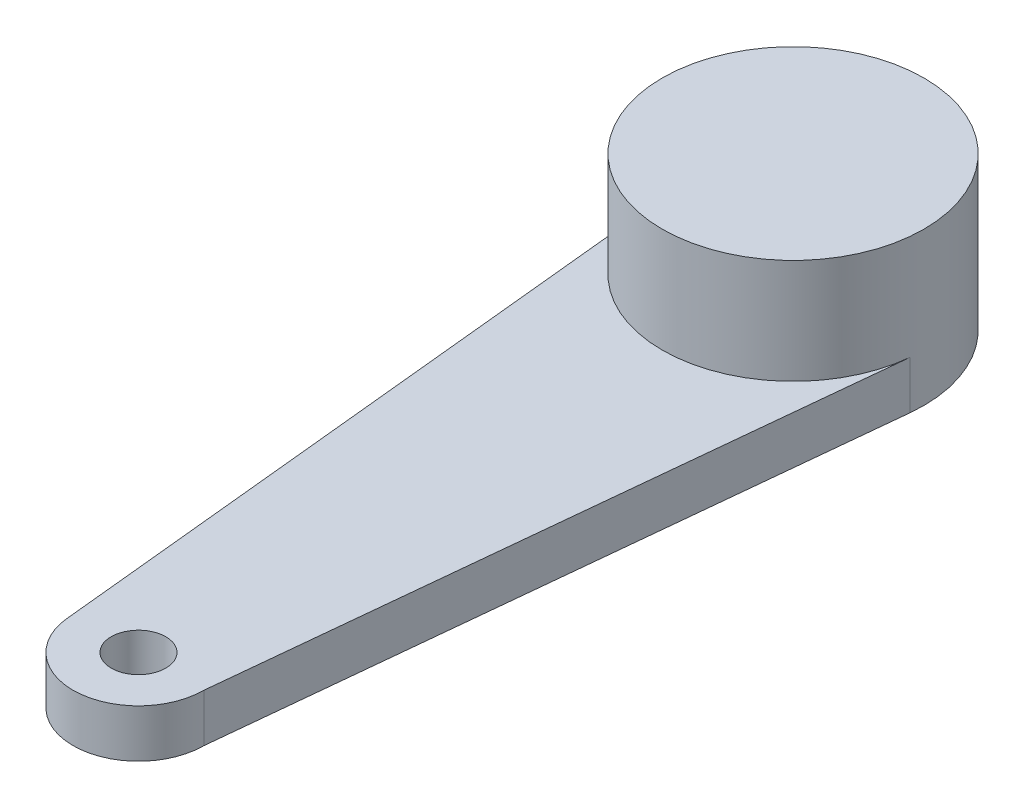
ISO-10303-21;
HEADER;
FILE_DESCRIPTION(('STEP AP214'),'2;1');
FILE_NAME('part.step','',(''),(''),'','','');
FILE_SCHEMA(('AUTOMOTIVE_DESIGN { 1 0 10303 214 1 1 1 1 }'));
ENDSEC;
DATA;
#1=APPLICATION_CONTEXT('core data for automotive mechanical design processes');
#2=APPLICATION_PROTOCOL_DEFINITION('international standard','automotive_design',2000,#1);
#3=PRODUCT_CONTEXT('',#1,'mechanical');
#4=PRODUCT('Part','Part','',(#3));
#5=PRODUCT_RELATED_PRODUCT_CATEGORY('part','',(#4));
#6=PRODUCT_DEFINITION_FORMATION('','',#4);
#7=PRODUCT_DEFINITION_CONTEXT('part definition',#1,'design');
#8=PRODUCT_DEFINITION('design','',#6,#7);
#9=PRODUCT_DEFINITION_SHAPE('','',#8);
#10=(LENGTH_UNIT() NAMED_UNIT(*) SI_UNIT(.MILLI.,.METRE.));
#11=(NAMED_UNIT(*) PLANE_ANGLE_UNIT() SI_UNIT($,.RADIAN.));
#12=(NAMED_UNIT(*) SI_UNIT($,.STERADIAN.) SOLID_ANGLE_UNIT());
#13=UNCERTAINTY_MEASURE_WITH_UNIT(LENGTH_MEASURE(1.E-05),#10,'distance_accuracy_value','');
#14=(GEOMETRIC_REPRESENTATION_CONTEXT(3) GLOBAL_UNCERTAINTY_ASSIGNED_CONTEXT((#13)) GLOBAL_UNIT_ASSIGNED_CONTEXT((#10,
#11,#12)) REPRESENTATION_CONTEXT('',''));
#15=CARTESIAN_POINT('',(0.,0.,0.));
#16=DIRECTION('',(0.,0.,1.));
#17=DIRECTION('',(1.,0.,0.));
#18=AXIS2_PLACEMENT_3D('',#15,#16,#17);
#19=CARTESIAN_POINT('',(0.,3.5,0.));
#20=DIRECTION('',(0.,-1.,0.));
#21=DIRECTION('',(0.,0.,-1.));
#22=AXIS2_PLACEMENT_3D('',#19,#20,#21);
#23=CYLINDRICAL_SURFACE('',#22,3.);
#24=CARTESIAN_POINT('',(0.,1.1,0.));
#25=DIRECTION('',(0.,1.,0.));
#26=DIRECTION('',(0.,0.,1.));
#27=AXIS2_PLACEMENT_3D('',#24,#25,#26);
#28=CIRCLE('',#27,3.);
#29=CARTESIAN_POINT('',(-2.98496231131986,1.1,0.3));
#30=VERTEX_POINT('',#29);
#31=CARTESIAN_POINT('',(2.98480924805825,1.1,0.301519075194175));
#32=VERTEX_POINT('',#31);
#33=EDGE_CURVE('E53',#30,#32,#28,.T.);
#34=ORIENTED_EDGE('',*,*,#33,.T.);
#35=DIRECTION('',(0.,-1.,0.));
#36=VECTOR('',#35,1.);
#37=CARTESIAN_POINT('',(2.98480924805825,1.1,0.301519075194175));
#38=LINE('',#37,#36);
#39=CARTESIAN_POINT('',(2.98480924805825,0.,0.301519075194175));
#40=VERTEX_POINT('',#39);
#41=EDGE_CURVE('E98',#32,#40,#38,.T.);
#42=ORIENTED_EDGE('',*,*,#41,.T.);
#43=CARTESIAN_POINT('',(0.,0.,0.));
#44=DIRECTION('',(0.,1.,0.));
#45=DIRECTION('',(0.,0.,1.));
#46=AXIS2_PLACEMENT_3D('',#43,#44,#45);
#47=CIRCLE('',#46,3.);
#48=CARTESIAN_POINT('',(-2.98496231131986,0.,0.3));
#49=VERTEX_POINT('',#48);
#50=EDGE_CURVE('E42',#40,#49,#47,.T.);
#51=ORIENTED_EDGE('',*,*,#50,.T.);
#52=DIRECTION('',(0.,-1.,0.));
#53=VECTOR('',#52,1.);
#54=CARTESIAN_POINT('',(-2.98496231131986,1.1,0.3));
#55=LINE('',#54,#53);
#56=EDGE_CURVE('E58',#30,#49,#55,.T.);
#57=ORIENTED_EDGE('',*,*,#56,.F.);
#58=EDGE_LOOP('',(#34,#42,#51,#57));
#59=FACE_BOUND('',#58,.T.);
#60=CARTESIAN_POINT('',(0.,3.5,0.));
#61=DIRECTION('',(0.,1.,0.));
#62=DIRECTION('',(0.,0.,1.));
#63=AXIS2_PLACEMENT_3D('',#60,#61,#62);
#64=CIRCLE('',#63,3.);
#65=CARTESIAN_POINT('',(0.,3.5,3.));
#66=VERTEX_POINT('',#65);
#67=EDGE_CURVE('E11',#66,#66,#64,.T.);
#68=ORIENTED_EDGE('',*,*,#67,.F.);
#69=EDGE_LOOP('',(#68));
#70=FACE_BOUND('',#69,.T.);
#71=ADVANCED_FACE('F39',(#59,#70),#23,.T.);
#72=CARTESIAN_POINT('',(0.,3.5,0.));
#73=DIRECTION('',(0.,1.,0.));
#74=DIRECTION('',(0.,0.,1.));
#75=AXIS2_PLACEMENT_3D('',#72,#73,#74);
#76=PLANE('',#75);
#77=ORIENTED_EDGE('',*,*,#67,.T.);
#78=EDGE_LOOP('',(#77));
#79=FACE_BOUND('',#78,.T.);
#80=ADVANCED_FACE('F137',(#79),#76,.T.);
#81=CARTESIAN_POINT('',(0.,0.,0.));
#82=DIRECTION('',(0.,1.,0.));
#83=DIRECTION('',(0.,0.,1.));
#84=AXIS2_PLACEMENT_3D('',#81,#82,#83);
#85=PLANE('',#84);
#86=ORIENTED_EDGE('',*,*,#50,.F.);
#87=DIRECTION('',(-0.100506358398058,0.,0.994936416019416));
#88=VECTOR('',#87,1.);
#89=CARTESIAN_POINT('',(2.98480924805825,0.,0.301519075194175));
#90=LINE('',#89,#88);
#91=CARTESIAN_POINT('',(1.5,0.,15.));
#92=VERTEX_POINT('',#91);
#93=EDGE_CURVE('E111',#40,#92,#90,.T.);
#94=ORIENTED_EDGE('',*,*,#93,.T.);
#95=CARTESIAN_POINT('',(0.,0.,15.));
#96=DIRECTION('',(0.,1.,0.));
#97=DIRECTION('',(0.,0.,1.));
#98=AXIS2_PLACEMENT_3D('',#95,#96,#97);
#99=CIRCLE('',#98,1.5);
#100=CARTESIAN_POINT('',(-1.49248115565993,0.,15.15));
#101=VERTEX_POINT('',#100);
#102=EDGE_CURVE('E94',#101,#92,#99,.T.);
#103=ORIENTED_EDGE('',*,*,#102,.F.);
#104=DIRECTION('',(0.1,0.,0.99498743710662));
#105=VECTOR('',#104,1.);
#106=CARTESIAN_POINT('',(-2.98496231131986,0.,0.3));
#107=LINE('',#106,#105);
#108=EDGE_CURVE('E113',#49,#101,#107,.T.);
#109=ORIENTED_EDGE('',*,*,#108,.F.);
#110=EDGE_LOOP('',(#86,#94,#103,#109));
#111=FACE_BOUND('',#110,.T.);
#112=CARTESIAN_POINT('',(0.,0.,15.));
#113=DIRECTION('',(0.,1.,0.));
#114=DIRECTION('',(0.,0.,1.));
#115=AXIS2_PLACEMENT_3D('',#112,#113,#114);
#116=CIRCLE('',#115,0.625);
#117=CARTESIAN_POINT('',(0.,0.,15.625));
#118=VERTEX_POINT('',#117);
#119=EDGE_CURVE('E107',#118,#118,#116,.T.);
#120=ORIENTED_EDGE('',*,*,#119,.T.);
#121=EDGE_LOOP('',(#120));
#122=FACE_BOUND('',#121,.T.);
#123=ADVANCED_FACE('F119',(#111,#122),#85,.F.);
#124=CARTESIAN_POINT('',(0.,1.1,15.));
#125=DIRECTION('',(0.,-1.,0.));
#126=DIRECTION('',(0.,0.,-1.));
#127=AXIS2_PLACEMENT_3D('',#124,#125,#126);
#128=CYLINDRICAL_SURFACE('',#127,1.5);
#129=ORIENTED_EDGE('',*,*,#102,.T.);
#130=DIRECTION('',(0.,-1.,0.));
#131=VECTOR('',#130,1.);
#132=CARTESIAN_POINT('',(1.5,1.1,15.));
#133=LINE('',#132,#131);
#134=CARTESIAN_POINT('',(1.5,1.1,15.));
#135=VERTEX_POINT('',#134);
#136=EDGE_CURVE('E91',#135,#92,#133,.T.);
#137=ORIENTED_EDGE('',*,*,#136,.F.);
#138=CARTESIAN_POINT('',(0.,1.1,15.));
#139=DIRECTION('',(0.,1.,0.));
#140=DIRECTION('',(0.,0.,1.));
#141=AXIS2_PLACEMENT_3D('',#138,#139,#140);
#142=CIRCLE('',#141,1.5);
#143=CARTESIAN_POINT('',(-1.49248115565993,1.1,15.15));
#144=VERTEX_POINT('',#143);
#145=EDGE_CURVE('E79',#144,#135,#142,.T.);
#146=ORIENTED_EDGE('',*,*,#145,.F.);
#147=DIRECTION('',(0.,-1.,0.));
#148=VECTOR('',#147,1.);
#149=CARTESIAN_POINT('',(-1.49248115565993,1.1,15.15));
#150=LINE('',#149,#148);
#151=EDGE_CURVE('E106',#144,#101,#150,.T.);
#152=ORIENTED_EDGE('',*,*,#151,.T.);
#153=EDGE_LOOP('',(#129,#137,#146,#152));
#154=FACE_BOUND('',#153,.T.);
#155=ADVANCED_FACE('F92',(#154),#128,.T.);
#156=CARTESIAN_POINT('',(2.98480924805825,1.1,0.301519075194175));
#157=DIRECTION('',(0.994936416019416,0.,0.100506358398058));
#158=DIRECTION('',(0.100506358398058,0.,-0.994936416019416));
#159=AXIS2_PLACEMENT_3D('',#156,#157,#158);
#160=PLANE('',#159);
#161=ORIENTED_EDGE('',*,*,#93,.F.);
#162=ORIENTED_EDGE('',*,*,#41,.F.);
#163=DIRECTION('',(-0.100506358398058,0.,0.994936416019416));
#164=VECTOR('',#163,1.);
#165=CARTESIAN_POINT('',(2.98480924805825,1.1,0.301519075194175));
#166=LINE('',#165,#164);
#167=EDGE_CURVE('E83',#32,#135,#166,.T.);
#168=ORIENTED_EDGE('',*,*,#167,.T.);
#169=ORIENTED_EDGE('',*,*,#136,.T.);
#170=EDGE_LOOP('',(#161,#162,#168,#169));
#171=FACE_BOUND('',#170,.T.);
#172=ADVANCED_FACE('F100',(#171),#160,.T.);
#173=CARTESIAN_POINT('',(0.,1.1,15.));
#174=DIRECTION('',(0.,-1.,0.));
#175=DIRECTION('',(0.,0.,-1.));
#176=AXIS2_PLACEMENT_3D('',#173,#174,#175);
#177=CYLINDRICAL_SURFACE('',#176,0.625);
#178=CARTESIAN_POINT('',(0.,1.1,15.));
#179=DIRECTION('',(0.,1.,0.));
#180=DIRECTION('',(0.,0.,1.));
#181=AXIS2_PLACEMENT_3D('',#178,#179,#180);
#182=CIRCLE('',#181,0.625);
#183=CARTESIAN_POINT('',(0.,1.1,15.625));
#184=VERTEX_POINT('',#183);
#185=EDGE_CURVE('E88',#184,#184,#182,.T.);
#186=ORIENTED_EDGE('',*,*,#185,.T.);
#187=EDGE_LOOP('',(#186));
#188=FACE_BOUND('',#187,.T.);
#189=ORIENTED_EDGE('',*,*,#119,.F.);
#190=EDGE_LOOP('',(#189));
#191=FACE_BOUND('',#190,.T.);
#192=ADVANCED_FACE('F125',(#188,#191),#177,.F.);
#193=CARTESIAN_POINT('',(-2.98496231131986,1.1,0.3));
#194=DIRECTION('',(0.99498743710662,0.,-0.1));
#195=DIRECTION('',(-0.1,0.,-0.99498743710662));
#196=AXIS2_PLACEMENT_3D('',#193,#194,#195);
#197=PLANE('',#196);
#198=ORIENTED_EDGE('',*,*,#108,.T.);
#199=ORIENTED_EDGE('',*,*,#151,.F.);
#200=DIRECTION('',(0.1,0.,0.99498743710662));
#201=VECTOR('',#200,1.);
#202=CARTESIAN_POINT('',(-2.98496231131986,1.1,0.3));
#203=LINE('',#202,#201);
#204=EDGE_CURVE('E84',#30,#144,#203,.T.);
#205=ORIENTED_EDGE('',*,*,#204,.F.);
#206=ORIENTED_EDGE('',*,*,#56,.T.);
#207=EDGE_LOOP('',(#198,#199,#205,#206));
#208=FACE_BOUND('',#207,.T.);
#209=ADVANCED_FACE('F123',(#208),#197,.F.);
#210=CARTESIAN_POINT('',(0.,1.1,0.));
#211=DIRECTION('',(0.,1.,0.));
#212=DIRECTION('',(0.,0.,1.));
#213=AXIS2_PLACEMENT_3D('',#210,#211,#212);
#214=PLANE('',#213);
#215=ORIENTED_EDGE('',*,*,#185,.F.);
#216=EDGE_LOOP('',(#215));
#217=FACE_BOUND('',#216,.T.);
#218=ORIENTED_EDGE('',*,*,#145,.T.);
#219=ORIENTED_EDGE('',*,*,#167,.F.);
#220=ORIENTED_EDGE('',*,*,#33,.F.);
#221=ORIENTED_EDGE('',*,*,#204,.T.);
#222=EDGE_LOOP('',(#218,#219,#220,#221));
#223=FACE_BOUND('',#222,.T.);
#224=ADVANCED_FACE('F81',(#217,#223),#214,.T.);
#225=CLOSED_SHELL('',(#71,#80,#123,#155,#172,#192,#209,#224));
#226=MANIFOLD_SOLID_BREP('B2',#225);
#227=ADVANCED_BREP_SHAPE_REPRESENTATION('',(#18,#226),#14);
#228=SHAPE_DEFINITION_REPRESENTATION(#9,#227);
ENDSEC;
END-ISO-10303-21;
